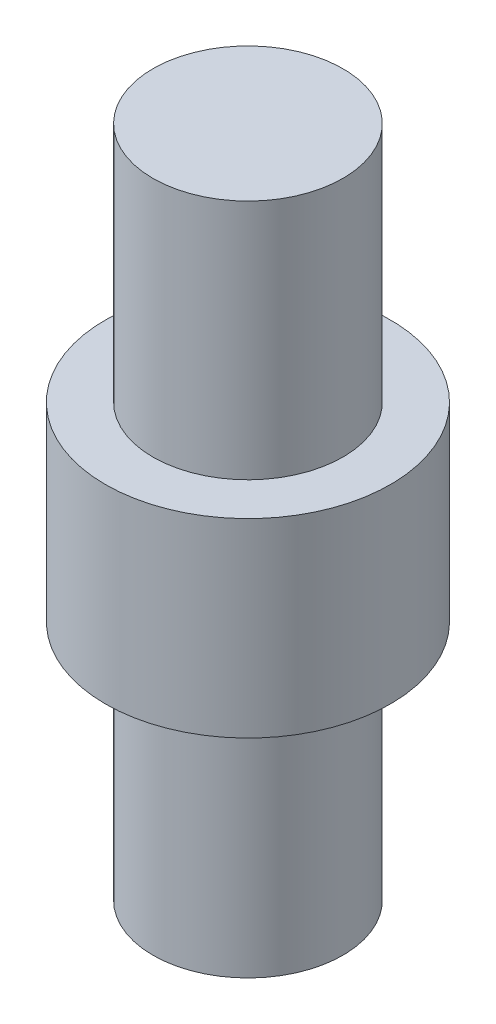
ISO-10303-21;
HEADER;
FILE_DESCRIPTION(('STEP AP214'),'2;1');
FILE_NAME('part.step','',(''),(''),'','','');
FILE_SCHEMA(('AUTOMOTIVE_DESIGN { 1 0 10303 214 1 1 1 1 }'));
ENDSEC;
DATA;
#1=APPLICATION_CONTEXT('core data for automotive mechanical design processes');
#2=APPLICATION_PROTOCOL_DEFINITION('international standard','automotive_design',2000,#1);
#3=PRODUCT_CONTEXT('',#1,'mechanical');
#4=PRODUCT('Part','Part','',(#3));
#5=PRODUCT_RELATED_PRODUCT_CATEGORY('part','',(#4));
#6=PRODUCT_DEFINITION_FORMATION('','',#4);
#7=PRODUCT_DEFINITION_CONTEXT('part definition',#1,'design');
#8=PRODUCT_DEFINITION('design','',#6,#7);
#9=PRODUCT_DEFINITION_SHAPE('','',#8);
#10=(LENGTH_UNIT() NAMED_UNIT(*) SI_UNIT(.MILLI.,.METRE.));
#11=(NAMED_UNIT(*) PLANE_ANGLE_UNIT() SI_UNIT($,.RADIAN.));
#12=(NAMED_UNIT(*) SI_UNIT($,.STERADIAN.) SOLID_ANGLE_UNIT());
#13=UNCERTAINTY_MEASURE_WITH_UNIT(LENGTH_MEASURE(1.E-05),#10,'distance_accuracy_value','');
#14=(GEOMETRIC_REPRESENTATION_CONTEXT(3) GLOBAL_UNCERTAINTY_ASSIGNED_CONTEXT((#13)) GLOBAL_UNIT_ASSIGNED_CONTEXT((#10,
#11,#12)) REPRESENTATION_CONTEXT('',''));
#15=CARTESIAN_POINT('',(0.,0.,0.));
#16=DIRECTION('',(0.,0.,1.));
#17=DIRECTION('',(1.,0.,0.));
#18=AXIS2_PLACEMENT_3D('',#15,#16,#17);
#19=CARTESIAN_POINT('',(0.,1.,0.));
#20=DIRECTION('',(0.,1.,0.));
#21=DIRECTION('',(0.,0.,1.));
#22=AXIS2_PLACEMENT_3D('',#19,#20,#21);
#23=PLANE('',#22);
#24=CARTESIAN_POINT('',(0.,1.,0.));
#25=DIRECTION('',(0.,1.,0.));
#26=DIRECTION('',(0.,0.,1.));
#27=AXIS2_PLACEMENT_3D('',#24,#25,#26);
#28=CIRCLE('',#27,1.5);
#29=CARTESIAN_POINT('',(0.,1.,1.5));
#30=VERTEX_POINT('',#29);
#31=EDGE_CURVE('E10',#30,#30,#28,.T.);
#32=ORIENTED_EDGE('',*,*,#31,.T.);
#33=EDGE_LOOP('',(#32));
#34=FACE_BOUND('',#33,.T.);
#35=CARTESIAN_POINT('',(0.,1.,0.));
#36=DIRECTION('',(0.,1.,0.));
#37=DIRECTION('',(0.,0.,1.));
#38=AXIS2_PLACEMENT_3D('',#35,#36,#37);
#39=CIRCLE('',#38,1.);
#40=CARTESIAN_POINT('',(0.,1.,1.));
#41=VERTEX_POINT('',#40);
#42=EDGE_CURVE('E44',#41,#41,#39,.T.);
#43=ORIENTED_EDGE('',*,*,#42,.F.);
#44=EDGE_LOOP('',(#43));
#45=FACE_BOUND('',#44,.T.);
#46=ADVANCED_FACE('F31',(#34,#45),#23,.T.);
#47=CARTESIAN_POINT('',(0.,1.,0.));
#48=DIRECTION('',(0.,-1.,0.));
#49=DIRECTION('',(0.,0.,-1.));
#50=AXIS2_PLACEMENT_3D('',#47,#48,#49);
#51=CYLINDRICAL_SURFACE('',#50,1.5);
#52=ORIENTED_EDGE('',*,*,#31,.F.);
#53=EDGE_LOOP('',(#52));
#54=FACE_BOUND('',#53,.T.);
#55=CARTESIAN_POINT('',(0.,-1.,0.));
#56=DIRECTION('',(0.,1.,0.));
#57=DIRECTION('',(0.,0.,1.));
#58=AXIS2_PLACEMENT_3D('',#55,#56,#57);
#59=CIRCLE('',#58,1.5);
#60=CARTESIAN_POINT('',(0.,-1.,1.5));
#61=VERTEX_POINT('',#60);
#62=EDGE_CURVE('E35',#61,#61,#59,.T.);
#63=ORIENTED_EDGE('',*,*,#62,.T.);
#64=EDGE_LOOP('',(#63));
#65=FACE_BOUND('',#64,.T.);
#66=ADVANCED_FACE('F33',(#54,#65),#51,.T.);
#67=CARTESIAN_POINT('',(0.,-1.,0.));
#68=DIRECTION('',(0.,1.,0.));
#69=DIRECTION('',(0.,0.,1.));
#70=AXIS2_PLACEMENT_3D('',#67,#68,#69);
#71=PLANE('',#70);
#72=CARTESIAN_POINT('',(0.,-1.,0.));
#73=DIRECTION('',(0.,1.,0.));
#74=DIRECTION('',(0.,0.,1.));
#75=AXIS2_PLACEMENT_3D('',#72,#73,#74);
#76=CIRCLE('',#75,1.);
#77=CARTESIAN_POINT('',(0.,-1.,1.));
#78=VERTEX_POINT('',#77);
#79=EDGE_CURVE('E50',#78,#78,#76,.T.);
#80=ORIENTED_EDGE('',*,*,#79,.T.);
#81=EDGE_LOOP('',(#80));
#82=FACE_BOUND('',#81,.T.);
#83=ORIENTED_EDGE('',*,*,#62,.F.);
#84=EDGE_LOOP('',(#83));
#85=FACE_BOUND('',#84,.T.);
#86=ADVANCED_FACE('F72',(#82,#85),#71,.F.);
#87=CARTESIAN_POINT('',(0.,3.54,0.));
#88=DIRECTION('',(0.,-1.,0.));
#89=DIRECTION('',(0.,0.,-1.));
#90=AXIS2_PLACEMENT_3D('',#87,#88,#89);
#91=CYLINDRICAL_SURFACE('',#90,1.);
#92=CARTESIAN_POINT('',(0.,3.54,0.));
#93=DIRECTION('',(0.,1.,0.));
#94=DIRECTION('',(0.,0.,1.));
#95=AXIS2_PLACEMENT_3D('',#92,#93,#94);
#96=CIRCLE('',#95,1.);
#97=CARTESIAN_POINT('',(0.,3.54,1.));
#98=VERTEX_POINT('',#97);
#99=EDGE_CURVE('E42',#98,#98,#96,.T.);
#100=ORIENTED_EDGE('',*,*,#99,.F.);
#101=EDGE_LOOP('',(#100));
#102=FACE_BOUND('',#101,.T.);
#103=ORIENTED_EDGE('',*,*,#42,.T.);
#104=EDGE_LOOP('',(#103));
#105=FACE_BOUND('',#104,.T.);
#106=ADVANCED_FACE('F76',(#102,#105),#91,.T.);
#107=CARTESIAN_POINT('',(0.,3.54,0.));
#108=DIRECTION('',(0.,1.,0.));
#109=DIRECTION('',(0.,0.,1.));
#110=AXIS2_PLACEMENT_3D('',#107,#108,#109);
#111=PLANE('',#110);
#112=ORIENTED_EDGE('',*,*,#99,.T.);
#113=EDGE_LOOP('',(#112));
#114=FACE_BOUND('',#113,.T.);
#115=ADVANCED_FACE('F65',(#114),#111,.T.);
#116=CARTESIAN_POINT('',(0.,-3.54,0.));
#117=DIRECTION('',(0.,1.,0.));
#118=DIRECTION('',(0.,0.,1.));
#119=AXIS2_PLACEMENT_3D('',#116,#117,#118);
#120=CYLINDRICAL_SURFACE('',#119,1.);
#121=CARTESIAN_POINT('',(0.,-3.54,0.));
#122=DIRECTION('',(0.,1.,0.));
#123=DIRECTION('',(0.,0.,1.));
#124=AXIS2_PLACEMENT_3D('',#121,#122,#123);
#125=CIRCLE('',#124,1.);
#126=CARTESIAN_POINT('',(0.,-3.54,1.));
#127=VERTEX_POINT('',#126);
#128=EDGE_CURVE('E47',#127,#127,#125,.T.);
#129=ORIENTED_EDGE('',*,*,#128,.T.);
#130=EDGE_LOOP('',(#129));
#131=FACE_BOUND('',#130,.T.);
#132=ORIENTED_EDGE('',*,*,#79,.F.);
#133=EDGE_LOOP('',(#132));
#134=FACE_BOUND('',#133,.T.);
#135=ADVANCED_FACE('F56',(#131,#134),#120,.T.);
#136=CARTESIAN_POINT('',(0.,-3.54,0.));
#137=DIRECTION('',(0.,-1.,0.));
#138=DIRECTION('',(0.,0.,1.));
#139=AXIS2_PLACEMENT_3D('',#136,#137,#138);
#140=PLANE('',#139);
#141=ORIENTED_EDGE('',*,*,#128,.F.);
#142=EDGE_LOOP('',(#141));
#143=FACE_BOUND('',#142,.T.);
#144=ADVANCED_FACE('F59',(#143),#140,.T.);
#145=CLOSED_SHELL('',(#46,#66,#86,#106,#115,#135,#144));
#146=MANIFOLD_SOLID_BREP('B2',#145);
#147=ADVANCED_BREP_SHAPE_REPRESENTATION('',(#18,#146),#14);
#148=SHAPE_DEFINITION_REPRESENTATION(#9,#147);
ENDSEC;
END-ISO-10303-21;
